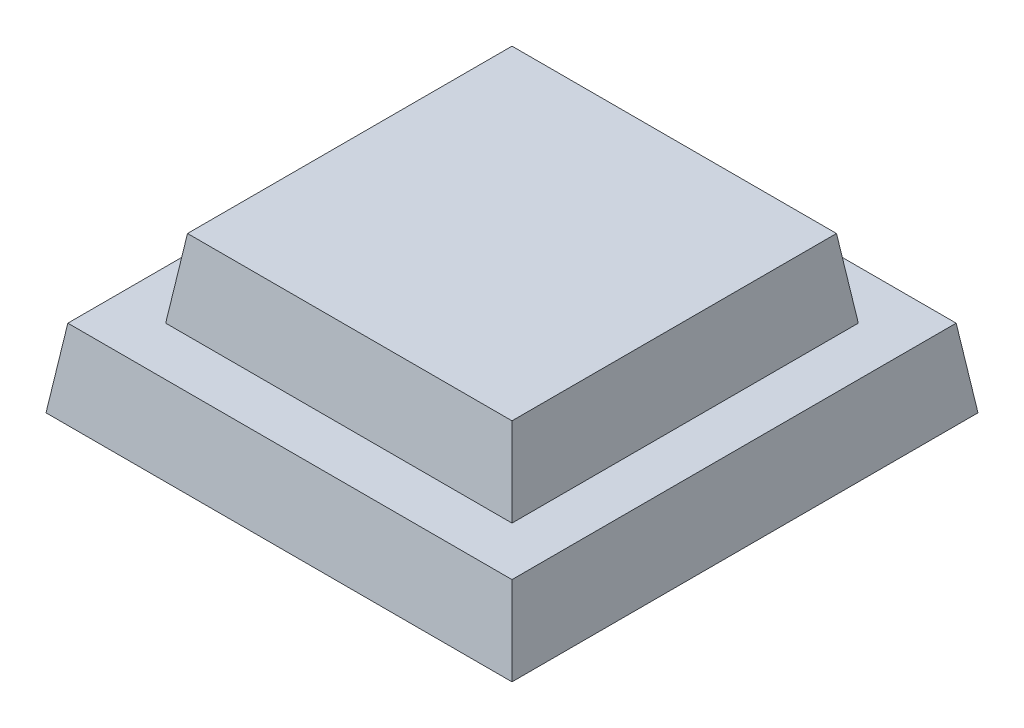
ISO-10303-21;
HEADER;
FILE_DESCRIPTION(('STEP AP214'),'2;1');
FILE_NAME('part.step','',(''),(''),'','','');
FILE_SCHEMA(('AUTOMOTIVE_DESIGN { 1 0 10303 214 1 1 1 1 }'));
ENDSEC;
DATA;
#1=APPLICATION_CONTEXT('core data for automotive mechanical design processes');
#2=APPLICATION_PROTOCOL_DEFINITION('international standard','automotive_design',2000,#1);
#3=PRODUCT_CONTEXT('',#1,'mechanical');
#4=PRODUCT('Part','Part','',(#3));
#5=PRODUCT_RELATED_PRODUCT_CATEGORY('part','',(#4));
#6=PRODUCT_DEFINITION_FORMATION('','',#4);
#7=PRODUCT_DEFINITION_CONTEXT('part definition',#1,'design');
#8=PRODUCT_DEFINITION('design','',#6,#7);
#9=PRODUCT_DEFINITION_SHAPE('','',#8);
#10=(LENGTH_UNIT() NAMED_UNIT(*) SI_UNIT(.MILLI.,.METRE.));
#11=(NAMED_UNIT(*) PLANE_ANGLE_UNIT() SI_UNIT($,.RADIAN.));
#12=(NAMED_UNIT(*) SI_UNIT($,.STERADIAN.) SOLID_ANGLE_UNIT());
#13=UNCERTAINTY_MEASURE_WITH_UNIT(LENGTH_MEASURE(1.E-05),#10,'distance_accuracy_value','');
#14=(GEOMETRIC_REPRESENTATION_CONTEXT(3) GLOBAL_UNCERTAINTY_ASSIGNED_CONTEXT((#13)) GLOBAL_UNIT_ASSIGNED_CONTEXT((#10,
#11,#12)) REPRESENTATION_CONTEXT('',''));
#15=CARTESIAN_POINT('',(0.,0.,0.));
#16=DIRECTION('',(0.,0.,1.));
#17=DIRECTION('',(1.,0.,0.));
#18=AXIS2_PLACEMENT_3D('',#15,#16,#17);
#19=CARTESIAN_POINT('',(0.,3.175,0.));
#20=DIRECTION('',(0.,1.,0.));
#21=DIRECTION('',(0.,0.,1.));
#22=AXIS2_PLACEMENT_3D('',#19,#20,#21);
#23=PLANE('',#22);
#24=DIRECTION('',(0.,0.,1.));
#25=VECTOR('',#24,1.);
#26=CARTESIAN_POINT('',(9.07878284981992,3.175,-9.52500000000001));
#27=LINE('',#26,#25);
#28=CARTESIAN_POINT('',(9.07878284981992,3.175,9.07878284981992));
#29=VERTEX_POINT('',#28);
#30=CARTESIAN_POINT('',(9.07878284981992,3.175,-9.07878284981992));
#31=VERTEX_POINT('',#30);
#32=EDGE_CURVE('E150',#29,#31,#27,.F.);
#33=ORIENTED_EDGE('',*,*,#32,.T.);
#34=DIRECTION('',(1.,0.,0.));
#35=VECTOR('',#34,1.);
#36=CARTESIAN_POINT('',(-9.52500000000001,3.175,-9.07878284981992));
#37=LINE('',#36,#35);
#38=CARTESIAN_POINT('',(-9.07878284981992,3.175,-9.07878284981992));
#39=VERTEX_POINT('',#38);
#40=EDGE_CURVE('E161',#31,#39,#37,.F.);
#41=ORIENTED_EDGE('',*,*,#40,.T.);
#42=DIRECTION('',(0.,0.,-1.));
#43=VECTOR('',#42,1.);
#44=CARTESIAN_POINT('',(-9.07878284981992,3.175,-9.52500000000001));
#45=LINE('',#44,#43);
#46=CARTESIAN_POINT('',(-9.07878284981992,3.175,9.07878284981992));
#47=VERTEX_POINT('',#46);
#48=EDGE_CURVE('E162',#39,#47,#45,.F.);
#49=ORIENTED_EDGE('',*,*,#48,.T.);
#50=DIRECTION('',(-1.,0.,0.));
#51=VECTOR('',#50,1.);
#52=CARTESIAN_POINT('',(-9.52500000000001,3.175,9.07878284981992));
#53=LINE('',#52,#51);
#54=EDGE_CURVE('E40',#47,#29,#53,.F.);
#55=ORIENTED_EDGE('',*,*,#54,.T.);
#56=EDGE_LOOP('',(#33,#41,#49,#55));
#57=FACE_BOUND('',#56,.T.);
#58=DIRECTION('',(1.,0.,0.));
#59=VECTOR('',#58,1.);
#60=CARTESIAN_POINT('',(-7.07878284981991,3.175,7.07878284981991));
#61=LINE('',#60,#59);
#62=CARTESIAN_POINT('',(-7.07878284981991,3.175,7.07878284981991));
#63=VERTEX_POINT('',#62);
#64=CARTESIAN_POINT('',(7.07878284981991,3.175,7.07878284981991));
#65=VERTEX_POINT('',#64);
#66=EDGE_CURVE('E108',#63,#65,#61,.T.);
#67=ORIENTED_EDGE('',*,*,#66,.F.);
#68=DIRECTION('',(0.,0.,1.));
#69=VECTOR('',#68,1.);
#70=CARTESIAN_POINT('',(-7.07878284981991,3.175,-7.07878284981991));
#71=LINE('',#70,#69);
#72=CARTESIAN_POINT('',(-7.07878284981991,3.175,-7.07878284981991));
#73=VERTEX_POINT('',#72);
#74=EDGE_CURVE('E119',#73,#63,#71,.T.);
#75=ORIENTED_EDGE('',*,*,#74,.F.);
#76=DIRECTION('',(-1.,0.,0.));
#77=VECTOR('',#76,1.);
#78=CARTESIAN_POINT('',(7.07878284981991,3.175,-7.07878284981991));
#79=LINE('',#78,#77);
#80=CARTESIAN_POINT('',(7.07878284981991,3.175,-7.07878284981991));
#81=VERTEX_POINT('',#80);
#82=EDGE_CURVE('E129',#81,#73,#79,.T.);
#83=ORIENTED_EDGE('',*,*,#82,.F.);
#84=DIRECTION('',(0.,0.,-1.));
#85=VECTOR('',#84,1.);
#86=CARTESIAN_POINT('',(7.07878284981991,3.175,7.07878284981991));
#87=LINE('',#86,#85);
#88=EDGE_CURVE('E127',#65,#81,#87,.T.);
#89=ORIENTED_EDGE('',*,*,#88,.F.);
#90=EDGE_LOOP('',(#67,#75,#83,#89));
#91=FACE_BOUND('',#90,.T.);
#92=ADVANCED_FACE('F36',(#57,#91),#23,.T.);
#93=CARTESIAN_POINT('',(9.52500000000001,0.,-9.52500000000001));
#94=DIRECTION('',(0.990268068741571,0.139173100960066,0.));
#95=DIRECTION('',(-0.139173100960066,0.99026806874157,0.));
#96=AXIS2_PLACEMENT_3D('',#93,#94,#95);
#97=PLANE('',#96);
#98=DIRECTION('',(0.,0.,-1.));
#99=VECTOR('',#98,1.);
#100=CARTESIAN_POINT('',(9.52500000000001,0.,-9.52500000000001));
#101=LINE('',#100,#99);
#102=CARTESIAN_POINT('',(9.52500000000001,0.,9.52500000000001));
#103=VERTEX_POINT('',#102);
#104=CARTESIAN_POINT('',(9.52500000000001,0.,-9.52500000000001));
#105=VERTEX_POINT('',#104);
#106=EDGE_CURVE('E114',#103,#105,#101,.T.);
#107=ORIENTED_EDGE('',*,*,#106,.T.);
#108=DIRECTION('',(0.137844537491629,-0.980814848463989,-0.137844537491629));
#109=VECTOR('',#108,1.);
#110=CARTESIAN_POINT('',(9.16302873036484,2.57555941233494,-9.16302873036484));
#111=LINE('',#110,#109);
#112=EDGE_CURVE('E11',#31,#105,#111,.T.);
#113=ORIENTED_EDGE('',*,*,#112,.F.);
#114=ORIENTED_EDGE('',*,*,#32,.F.);
#115=DIRECTION('',(0.137844537491629,-0.980814848463989,0.137844537491629));
#116=VECTOR('',#115,1.);
#117=CARTESIAN_POINT('',(9.16302873036484,2.57555941233494,9.16302873036484));
#118=LINE('',#117,#116);
#119=EDGE_CURVE('E152',#29,#103,#118,.T.);
#120=ORIENTED_EDGE('',*,*,#119,.T.);
#121=EDGE_LOOP('',(#107,#113,#114,#120));
#122=FACE_BOUND('',#121,.T.);
#123=ADVANCED_FACE('F176',(#122),#97,.T.);
#124=CARTESIAN_POINT('',(-9.52500000000001,0.,-9.52500000000001));
#125=DIRECTION('',(0.,0.139173100960066,-0.990268068741571));
#126=DIRECTION('',(0.,0.99026806874157,0.139173100960066));
#127=AXIS2_PLACEMENT_3D('',#124,#125,#126);
#128=PLANE('',#127);
#129=DIRECTION('',(-1.,0.,0.));
#130=VECTOR('',#129,1.);
#131=CARTESIAN_POINT('',(-9.52500000000001,0.,-9.52500000000001));
#132=LINE('',#131,#130);
#133=CARTESIAN_POINT('',(-9.52500000000001,0.,-9.52500000000001));
#134=VERTEX_POINT('',#133);
#135=EDGE_CURVE('E145',#105,#134,#132,.T.);
#136=ORIENTED_EDGE('',*,*,#135,.T.);
#137=DIRECTION('',(-0.137844537491629,-0.980814848463989,-0.137844537491629));
#138=VECTOR('',#137,1.);
#139=CARTESIAN_POINT('',(-9.52500000000001,0.,-9.52500000000001));
#140=LINE('',#139,#138);
#141=EDGE_CURVE('E45',#39,#134,#140,.T.);
#142=ORIENTED_EDGE('',*,*,#141,.F.);
#143=ORIENTED_EDGE('',*,*,#40,.F.);
#144=ORIENTED_EDGE('',*,*,#112,.T.);
#145=EDGE_LOOP('',(#136,#142,#143,#144));
#146=FACE_BOUND('',#145,.T.);
#147=ADVANCED_FACE('F38',(#146),#128,.T.);
#148=CARTESIAN_POINT('',(-9.52500000000001,0.,-9.52500000000001));
#149=DIRECTION('',(-0.990268068741571,0.139173100960066,0.));
#150=DIRECTION('',(-0.139173100960066,-0.99026806874157,0.));
#151=AXIS2_PLACEMENT_3D('',#148,#149,#150);
#152=PLANE('',#151);
#153=DIRECTION('',(0.,0.,1.));
#154=VECTOR('',#153,1.);
#155=CARTESIAN_POINT('',(-9.52500000000001,0.,-9.52500000000001));
#156=LINE('',#155,#154);
#157=CARTESIAN_POINT('',(-9.52500000000001,0.,9.52500000000001));
#158=VERTEX_POINT('',#157);
#159=EDGE_CURVE('E147',#134,#158,#156,.T.);
#160=ORIENTED_EDGE('',*,*,#159,.T.);
#161=DIRECTION('',(-0.137844537491629,-0.980814848463989,0.137844537491629));
#162=VECTOR('',#161,1.);
#163=CARTESIAN_POINT('',(-9.52500000000001,0.,9.52500000000001));
#164=LINE('',#163,#162);
#165=EDGE_CURVE('E155',#47,#158,#164,.T.);
#166=ORIENTED_EDGE('',*,*,#165,.F.);
#167=ORIENTED_EDGE('',*,*,#48,.F.);
#168=ORIENTED_EDGE('',*,*,#141,.T.);
#169=EDGE_LOOP('',(#160,#166,#167,#168));
#170=FACE_BOUND('',#169,.T.);
#171=ADVANCED_FACE('F167',(#170),#152,.T.);
#172=CARTESIAN_POINT('',(-9.52500000000001,0.,9.52500000000001));
#173=DIRECTION('',(0.,0.139173100960066,0.990268068741571));
#174=DIRECTION('',(0.,-0.99026806874157,0.139173100960066));
#175=AXIS2_PLACEMENT_3D('',#172,#173,#174);
#176=PLANE('',#175);
#177=DIRECTION('',(1.,0.,0.));
#178=VECTOR('',#177,1.);
#179=CARTESIAN_POINT('',(-9.52500000000001,0.,9.52500000000001));
#180=LINE('',#179,#178);
#181=EDGE_CURVE('E149',#158,#103,#180,.T.);
#182=ORIENTED_EDGE('',*,*,#181,.T.);
#183=ORIENTED_EDGE('',*,*,#119,.F.);
#184=ORIENTED_EDGE('',*,*,#54,.F.);
#185=ORIENTED_EDGE('',*,*,#165,.T.);
#186=EDGE_LOOP('',(#182,#183,#184,#185));
#187=FACE_BOUND('',#186,.T.);
#188=ADVANCED_FACE('F171',(#187),#176,.T.);
#189=CARTESIAN_POINT('',(0.,0.,0.));
#190=DIRECTION('',(0.,1.,0.));
#191=DIRECTION('',(0.,0.,1.));
#192=AXIS2_PLACEMENT_3D('',#189,#190,#191);
#193=PLANE('',#192);
#194=ORIENTED_EDGE('',*,*,#106,.F.);
#195=ORIENTED_EDGE('',*,*,#181,.F.);
#196=ORIENTED_EDGE('',*,*,#159,.F.);
#197=ORIENTED_EDGE('',*,*,#135,.F.);
#198=EDGE_LOOP('',(#194,#195,#196,#197));
#199=FACE_BOUND('',#198,.T.);
#200=ADVANCED_FACE('F179',(#199),#193,.F.);
#201=CARTESIAN_POINT('',(-7.07878284981991,3.175,-7.07878284981991));
#202=DIRECTION('',(-0.990268068741571,0.139173100960066,0.));
#203=DIRECTION('',(-0.139173100960066,-0.99026806874157,0.));
#204=AXIS2_PLACEMENT_3D('',#201,#202,#203);
#205=PLANE('',#204);
#206=ORIENTED_EDGE('',*,*,#74,.T.);
#207=DIRECTION('',(-0.137844537491629,-0.980814848463989,0.137844537491629));
#208=VECTOR('',#207,1.);
#209=CARTESIAN_POINT('',(-7.07878284981991,3.175,7.07878284981991));
#210=LINE('',#209,#208);
#211=CARTESIAN_POINT('',(-6.63256569963982,6.35,6.63256569963982));
#212=VERTEX_POINT('',#211);
#213=EDGE_CURVE('E103',#212,#63,#210,.T.);
#214=ORIENTED_EDGE('',*,*,#213,.F.);
#215=DIRECTION('',(0.,0.,-1.));
#216=VECTOR('',#215,1.);
#217=CARTESIAN_POINT('',(-6.63256569963982,6.35,-7.07878284981991));
#218=LINE('',#217,#216);
#219=CARTESIAN_POINT('',(-6.63256569963982,6.35,-6.63256569963982));
#220=VERTEX_POINT('',#219);
#221=EDGE_CURVE('E132',#220,#212,#218,.F.);
#222=ORIENTED_EDGE('',*,*,#221,.F.);
#223=DIRECTION('',(-0.137844537491629,-0.980814848463989,-0.137844537491629));
#224=VECTOR('',#223,1.);
#225=CARTESIAN_POINT('',(-7.07878284981991,3.175,-7.07878284981991));
#226=LINE('',#225,#224);
#227=EDGE_CURVE('E122',#220,#73,#226,.T.);
#228=ORIENTED_EDGE('',*,*,#227,.T.);
#229=EDGE_LOOP('',(#206,#214,#222,#228));
#230=FACE_BOUND('',#229,.T.);
#231=ADVANCED_FACE('F120',(#230),#205,.T.);
#232=CARTESIAN_POINT('',(-7.07878284981991,3.175,7.07878284981991));
#233=DIRECTION('',(0.,0.139173100960066,0.990268068741571));
#234=DIRECTION('',(0.,-0.99026806874157,0.139173100960066));
#235=AXIS2_PLACEMENT_3D('',#232,#233,#234);
#236=PLANE('',#235);
#237=ORIENTED_EDGE('',*,*,#66,.T.);
#238=DIRECTION('',(0.137844537491629,-0.980814848463989,0.137844537491629));
#239=VECTOR('',#238,1.);
#240=CARTESIAN_POINT('',(7.07878284981991,3.175,7.07878284981991));
#241=LINE('',#240,#239);
#242=CARTESIAN_POINT('',(6.63256569963982,6.35,6.63256569963982));
#243=VERTEX_POINT('',#242);
#244=EDGE_CURVE('E115',#243,#65,#241,.T.);
#245=ORIENTED_EDGE('',*,*,#244,.F.);
#246=DIRECTION('',(-1.,0.,0.));
#247=VECTOR('',#246,1.);
#248=CARTESIAN_POINT('',(-7.07878284981991,6.35,6.63256569963982));
#249=LINE('',#248,#247);
#250=EDGE_CURVE('E110',#212,#243,#249,.F.);
#251=ORIENTED_EDGE('',*,*,#250,.F.);
#252=ORIENTED_EDGE('',*,*,#213,.T.);
#253=EDGE_LOOP('',(#237,#245,#251,#252));
#254=FACE_BOUND('',#253,.T.);
#255=ADVANCED_FACE('F105',(#254),#236,.T.);
#256=CARTESIAN_POINT('',(7.07878284981991,3.175,7.07878284981991));
#257=DIRECTION('',(0.990268068741571,0.139173100960066,0.));
#258=DIRECTION('',(-0.139173100960066,0.99026806874157,0.));
#259=AXIS2_PLACEMENT_3D('',#256,#257,#258);
#260=PLANE('',#259);
#261=ORIENTED_EDGE('',*,*,#88,.T.);
#262=DIRECTION('',(0.137844537491629,-0.980814848463989,-0.137844537491629));
#263=VECTOR('',#262,1.);
#264=CARTESIAN_POINT('',(7.07878284981991,3.175,-7.07878284981991));
#265=LINE('',#264,#263);
#266=CARTESIAN_POINT('',(6.63256569963982,6.35,-6.63256569963982));
#267=VERTEX_POINT('',#266);
#268=EDGE_CURVE('E53',#267,#81,#265,.T.);
#269=ORIENTED_EDGE('',*,*,#268,.F.);
#270=DIRECTION('',(0.,0.,1.));
#271=VECTOR('',#270,1.);
#272=CARTESIAN_POINT('',(6.63256569963982,6.35,7.07878284981991));
#273=LINE('',#272,#271);
#274=EDGE_CURVE('E140',#243,#267,#273,.F.);
#275=ORIENTED_EDGE('',*,*,#274,.F.);
#276=ORIENTED_EDGE('',*,*,#244,.T.);
#277=EDGE_LOOP('',(#261,#269,#275,#276));
#278=FACE_BOUND('',#277,.T.);
#279=ADVANCED_FACE('F197',(#278),#260,.T.);
#280=CARTESIAN_POINT('',(7.07878284981991,3.175,-7.07878284981991));
#281=DIRECTION('',(0.,0.139173100960066,-0.990268068741571));
#282=DIRECTION('',(0.,0.99026806874157,0.139173100960066));
#283=AXIS2_PLACEMENT_3D('',#280,#281,#282);
#284=PLANE('',#283);
#285=ORIENTED_EDGE('',*,*,#82,.T.);
#286=ORIENTED_EDGE('',*,*,#227,.F.);
#287=DIRECTION('',(1.,0.,0.));
#288=VECTOR('',#287,1.);
#289=CARTESIAN_POINT('',(7.07878284981991,6.35,-6.63256569963982));
#290=LINE('',#289,#288);
#291=EDGE_CURVE('E135',#267,#220,#290,.F.);
#292=ORIENTED_EDGE('',*,*,#291,.F.);
#293=ORIENTED_EDGE('',*,*,#268,.T.);
#294=EDGE_LOOP('',(#285,#286,#292,#293));
#295=FACE_BOUND('',#294,.T.);
#296=ADVANCED_FACE('F200',(#295),#284,.T.);
#297=CARTESIAN_POINT('',(0.,6.35,0.));
#298=DIRECTION('',(0.,1.,0.));
#299=DIRECTION('',(0.,0.,1.));
#300=AXIS2_PLACEMENT_3D('',#297,#298,#299);
#301=PLANE('',#300);
#302=ORIENTED_EDGE('',*,*,#221,.T.);
#303=ORIENTED_EDGE('',*,*,#250,.T.);
#304=ORIENTED_EDGE('',*,*,#274,.T.);
#305=ORIENTED_EDGE('',*,*,#291,.T.);
#306=EDGE_LOOP('',(#302,#303,#304,#305));
#307=FACE_BOUND('',#306,.T.);
#308=ADVANCED_FACE('F203',(#307),#301,.T.);
#309=CLOSED_SHELL('',(#92,#123,#147,#171,#188,#200,#231,#255,#279,#296,#308));
#310=MANIFOLD_SOLID_BREP('B2',#309);
#311=ADVANCED_BREP_SHAPE_REPRESENTATION('',(#18,#310),#14);
#312=SHAPE_DEFINITION_REPRESENTATION(#9,#311);
ENDSEC;
END-ISO-10303-21;
